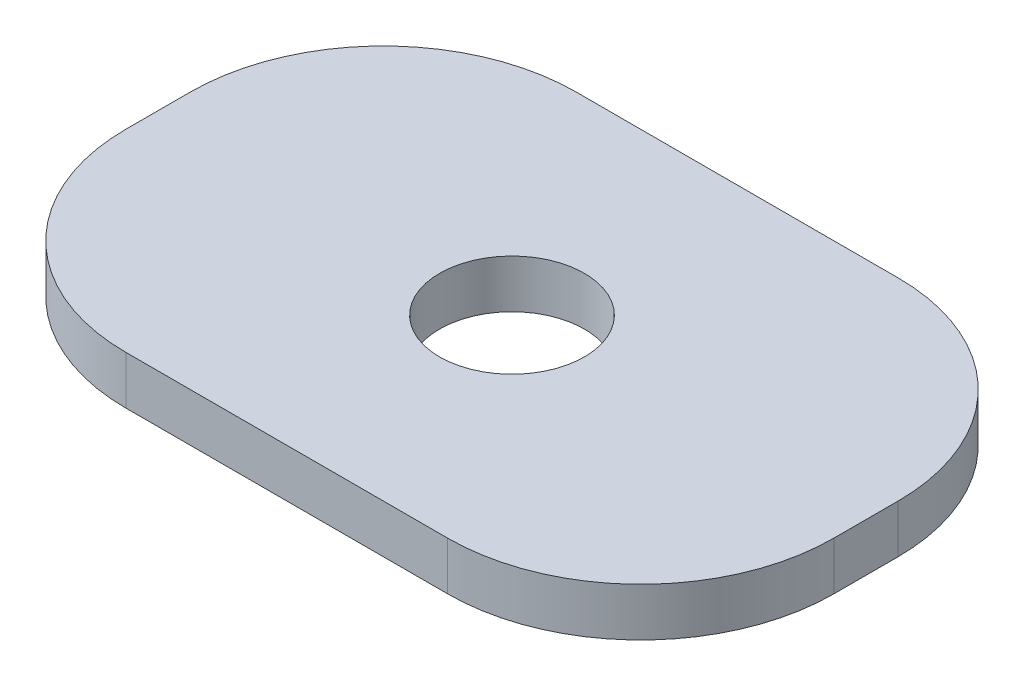
ISO-10303-21;
HEADER;
FILE_DESCRIPTION(('STEP AP214'),'2;1');
FILE_NAME('part.step','',(''),(''),'','','');
FILE_SCHEMA(('AUTOMOTIVE_DESIGN { 1 0 10303 214 1 1 1 1 }'));
ENDSEC;
DATA;
#1=APPLICATION_CONTEXT('core data for automotive mechanical design processes');
#2=APPLICATION_PROTOCOL_DEFINITION('international standard','automotive_design',2000,#1);
#3=PRODUCT_CONTEXT('',#1,'mechanical');
#4=PRODUCT('Part','Part','',(#3));
#5=PRODUCT_RELATED_PRODUCT_CATEGORY('part','',(#4));
#6=PRODUCT_DEFINITION_FORMATION('','',#4);
#7=PRODUCT_DEFINITION_CONTEXT('part definition',#1,'design');
#8=PRODUCT_DEFINITION('design','',#6,#7);
#9=PRODUCT_DEFINITION_SHAPE('','',#8);
#10=(LENGTH_UNIT() NAMED_UNIT(*) SI_UNIT(.MILLI.,.METRE.));
#11=(NAMED_UNIT(*) PLANE_ANGLE_UNIT() SI_UNIT($,.RADIAN.));
#12=(NAMED_UNIT(*) SI_UNIT($,.STERADIAN.) SOLID_ANGLE_UNIT());
#13=UNCERTAINTY_MEASURE_WITH_UNIT(LENGTH_MEASURE(1.E-05),#10,'distance_accuracy_value','');
#14=(GEOMETRIC_REPRESENTATION_CONTEXT(3) GLOBAL_UNCERTAINTY_ASSIGNED_CONTEXT((#13)) GLOBAL_UNIT_ASSIGNED_CONTEXT((#10,
#11,#12)) REPRESENTATION_CONTEXT('',''));
#15=CARTESIAN_POINT('',(0.,0.,0.));
#16=DIRECTION('',(0.,0.,1.));
#17=DIRECTION('',(1.,0.,0.));
#18=AXIS2_PLACEMENT_3D('',#15,#16,#17);
#19=CARTESIAN_POINT('',(34.925,4.7625,22.225));
#20=DIRECTION('',(-1.,0.,0.));
#21=DIRECTION('',(0.,0.,1.));
#22=AXIS2_PLACEMENT_3D('',#19,#20,#21);
#23=PLANE('',#22);
#24=DIRECTION('',(0.,0.,-1.));
#25=VECTOR('',#24,1.);
#26=CARTESIAN_POINT('',(34.925,4.7625,22.225));
#27=LINE('',#26,#25);
#28=CARTESIAN_POINT('',(34.925,4.7625,3.175));
#29=VERTEX_POINT('',#28);
#30=CARTESIAN_POINT('',(34.925,4.7625,-3.175));
#31=VERTEX_POINT('',#30);
#32=EDGE_CURVE('E130',#29,#31,#27,.T.);
#33=ORIENTED_EDGE('',*,*,#32,.F.);
#34=DIRECTION('',(0.,-1.,0.));
#35=VECTOR('',#34,1.);
#36=CARTESIAN_POINT('',(34.925,4.7625,3.175));
#37=LINE('',#36,#35);
#38=CARTESIAN_POINT('',(34.925,0.,3.175));
#39=VERTEX_POINT('',#38);
#40=EDGE_CURVE('E149',#29,#39,#37,.T.);
#41=ORIENTED_EDGE('',*,*,#40,.T.);
#42=DIRECTION('',(0.,0.,-1.));
#43=VECTOR('',#42,1.);
#44=CARTESIAN_POINT('',(34.925,0.,22.225));
#45=LINE('',#44,#43);
#46=CARTESIAN_POINT('',(34.925,0.,-3.175));
#47=VERTEX_POINT('',#46);
#48=EDGE_CURVE('E132',#39,#47,#45,.T.);
#49=ORIENTED_EDGE('',*,*,#48,.T.);
#50=DIRECTION('',(0.,-1.,0.));
#51=VECTOR('',#50,1.);
#52=CARTESIAN_POINT('',(34.925,4.7625,-3.175));
#53=LINE('',#52,#51);
#54=EDGE_CURVE('E147',#47,#31,#53,.F.);
#55=ORIENTED_EDGE('',*,*,#54,.T.);
#56=EDGE_LOOP('',(#33,#41,#49,#55));
#57=FACE_BOUND('',#56,.T.);
#58=ADVANCED_FACE('F33',(#57),#23,.F.);
#59=CARTESIAN_POINT('',(-34.925,4.7625,-22.225));
#60=DIRECTION('',(0.,0.,1.));
#61=DIRECTION('',(1.,0.,0.));
#62=AXIS2_PLACEMENT_3D('',#59,#60,#61);
#63=PLANE('',#62);
#64=DIRECTION('',(-1.,0.,0.));
#65=VECTOR('',#64,1.);
#66=CARTESIAN_POINT('',(-34.925,4.7625,-22.225));
#67=LINE('',#66,#65);
#68=CARTESIAN_POINT('',(15.875,4.7625,-22.225));
#69=VERTEX_POINT('',#68);
#70=CARTESIAN_POINT('',(-15.875,4.7625,-22.225));
#71=VERTEX_POINT('',#70);
#72=EDGE_CURVE('E165',#69,#71,#67,.T.);
#73=ORIENTED_EDGE('',*,*,#72,.F.);
#74=DIRECTION('',(0.,-1.,0.));
#75=VECTOR('',#74,1.);
#76=CARTESIAN_POINT('',(15.875,4.7625,-22.225));
#77=LINE('',#76,#75);
#78=CARTESIAN_POINT('',(15.875,0.,-22.225));
#79=VERTEX_POINT('',#78);
#80=EDGE_CURVE('E11',#69,#79,#77,.T.);
#81=ORIENTED_EDGE('',*,*,#80,.T.);
#82=DIRECTION('',(-1.,0.,0.));
#83=VECTOR('',#82,1.);
#84=CARTESIAN_POINT('',(-34.925,0.,-22.225));
#85=LINE('',#84,#83);
#86=CARTESIAN_POINT('',(-15.875,0.,-22.225));
#87=VERTEX_POINT('',#86);
#88=EDGE_CURVE('E128',#79,#87,#85,.T.);
#89=ORIENTED_EDGE('',*,*,#88,.T.);
#90=DIRECTION('',(0.,-1.,0.));
#91=VECTOR('',#90,1.);
#92=CARTESIAN_POINT('',(-15.875,4.7625,-22.225));
#93=LINE('',#92,#91);
#94=EDGE_CURVE('E108',#87,#71,#93,.F.);
#95=ORIENTED_EDGE('',*,*,#94,.T.);
#96=EDGE_LOOP('',(#73,#81,#89,#95));
#97=FACE_BOUND('',#96,.T.);
#98=ADVANCED_FACE('F198',(#97),#63,.F.);
#99=CARTESIAN_POINT('',(-34.925,4.7625,22.225));
#100=DIRECTION('',(1.,0.,0.));
#101=DIRECTION('',(0.,0.,-1.));
#102=AXIS2_PLACEMENT_3D('',#99,#100,#101);
#103=PLANE('',#102);
#104=DIRECTION('',(0.,0.,1.));
#105=VECTOR('',#104,1.);
#106=CARTESIAN_POINT('',(-34.925,4.7625,22.225));
#107=LINE('',#106,#105);
#108=CARTESIAN_POINT('',(-34.925,4.7625,-3.175));
#109=VERTEX_POINT('',#108);
#110=CARTESIAN_POINT('',(-34.925,4.7625,3.175));
#111=VERTEX_POINT('',#110);
#112=EDGE_CURVE('E121',#109,#111,#107,.T.);
#113=ORIENTED_EDGE('',*,*,#112,.F.);
#114=DIRECTION('',(0.,-1.,0.));
#115=VECTOR('',#114,1.);
#116=CARTESIAN_POINT('',(-34.925,4.7625,-3.175));
#117=LINE('',#116,#115);
#118=CARTESIAN_POINT('',(-34.925,0.,-3.175));
#119=VERTEX_POINT('',#118);
#120=EDGE_CURVE('E106',#109,#119,#117,.T.);
#121=ORIENTED_EDGE('',*,*,#120,.T.);
#122=DIRECTION('',(0.,0.,1.));
#123=VECTOR('',#122,1.);
#124=CARTESIAN_POINT('',(-34.925,0.,22.225));
#125=LINE('',#124,#123);
#126=CARTESIAN_POINT('',(-34.925,0.,3.175));
#127=VERTEX_POINT('',#126);
#128=EDGE_CURVE('E118',#119,#127,#125,.T.);
#129=ORIENTED_EDGE('',*,*,#128,.T.);
#130=DIRECTION('',(0.,-1.,0.));
#131=VECTOR('',#130,1.);
#132=CARTESIAN_POINT('',(-34.925,4.7625,3.175));
#133=LINE('',#132,#131);
#134=EDGE_CURVE('E122',#127,#111,#133,.F.);
#135=ORIENTED_EDGE('',*,*,#134,.T.);
#136=EDGE_LOOP('',(#113,#121,#129,#135));
#137=FACE_BOUND('',#136,.T.);
#138=ADVANCED_FACE('F117',(#137),#103,.F.);
#139=CARTESIAN_POINT('',(-34.925,4.7625,22.225));
#140=DIRECTION('',(0.,0.,-1.));
#141=DIRECTION('',(-1.,0.,0.));
#142=AXIS2_PLACEMENT_3D('',#139,#140,#141);
#143=PLANE('',#142);
#144=DIRECTION('',(1.,0.,0.));
#145=VECTOR('',#144,1.);
#146=CARTESIAN_POINT('',(-34.925,0.,22.225));
#147=LINE('',#146,#145);
#148=CARTESIAN_POINT('',(-15.875,0.,22.225));
#149=VERTEX_POINT('',#148);
#150=CARTESIAN_POINT('',(15.875,0.,22.225));
#151=VERTEX_POINT('',#150);
#152=EDGE_CURVE('E127',#149,#151,#147,.T.);
#153=ORIENTED_EDGE('',*,*,#152,.T.);
#154=DIRECTION('',(0.,-1.,0.));
#155=VECTOR('',#154,1.);
#156=CARTESIAN_POINT('',(15.875,4.7625,22.225));
#157=LINE('',#156,#155);
#158=CARTESIAN_POINT('',(15.875,4.7625,22.225));
#159=VERTEX_POINT('',#158);
#160=EDGE_CURVE('E56',#151,#159,#157,.F.);
#161=ORIENTED_EDGE('',*,*,#160,.T.);
#162=DIRECTION('',(1.,0.,0.));
#163=VECTOR('',#162,1.);
#164=CARTESIAN_POINT('',(-34.925,4.7625,22.225));
#165=LINE('',#164,#163);
#166=CARTESIAN_POINT('',(-15.875,4.7625,22.225));
#167=VERTEX_POINT('',#166);
#168=EDGE_CURVE('E136',#167,#159,#165,.T.);
#169=ORIENTED_EDGE('',*,*,#168,.F.);
#170=DIRECTION('',(0.,-1.,0.));
#171=VECTOR('',#170,1.);
#172=CARTESIAN_POINT('',(-15.875,4.7625,22.225));
#173=LINE('',#172,#171);
#174=EDGE_CURVE('E144',#167,#149,#173,.T.);
#175=ORIENTED_EDGE('',*,*,#174,.T.);
#176=EDGE_LOOP('',(#153,#161,#169,#175));
#177=FACE_BOUND('',#176,.T.);
#178=ADVANCED_FACE('F168',(#177),#143,.F.);
#179=CARTESIAN_POINT('',(0.,4.7625,0.));
#180=DIRECTION('',(0.,-1.,0.));
#181=DIRECTION('',(0.,0.,-1.));
#182=AXIS2_PLACEMENT_3D('',#179,#180,#181);
#183=PLANE('',#182);
#184=CARTESIAN_POINT('',(0.,4.7625,0.));
#185=DIRECTION('',(0.,1.,0.));
#186=DIRECTION('',(0.,0.,1.));
#187=AXIS2_PLACEMENT_3D('',#184,#185,#186);
#188=CIRCLE('',#187,7.14375);
#189=CARTESIAN_POINT('',(0.,4.7625,7.14375));
#190=VERTEX_POINT('',#189);
#191=EDGE_CURVE('E178',#190,#190,#188,.T.);
#192=ORIENTED_EDGE('',*,*,#191,.F.);
#193=EDGE_LOOP('',(#192));
#194=FACE_BOUND('',#193,.T.);
#195=ORIENTED_EDGE('',*,*,#168,.T.);
#196=CARTESIAN_POINT('',(15.875,4.7625,3.175));
#197=DIRECTION('',(0.,-1.,0.));
#198=DIRECTION('',(0.,0.,-1.));
#199=AXIS2_PLACEMENT_3D('',#196,#197,#198);
#200=CIRCLE('',#199,19.05);
#201=EDGE_CURVE('E41',#159,#29,#200,.F.);
#202=ORIENTED_EDGE('',*,*,#201,.T.);
#203=ORIENTED_EDGE('',*,*,#32,.T.);
#204=CARTESIAN_POINT('',(15.875,4.7625,-3.175));
#205=DIRECTION('',(0.,-1.,0.));
#206=DIRECTION('',(0.,0.,-1.));
#207=AXIS2_PLACEMENT_3D('',#204,#205,#206);
#208=CIRCLE('',#207,19.05);
#209=EDGE_CURVE('E48',#31,#69,#208,.F.);
#210=ORIENTED_EDGE('',*,*,#209,.T.);
#211=ORIENTED_EDGE('',*,*,#72,.T.);
#212=CARTESIAN_POINT('',(-15.875,4.7625,-3.175));
#213=DIRECTION('',(0.,-1.,0.));
#214=DIRECTION('',(0.,0.,-1.));
#215=AXIS2_PLACEMENT_3D('',#212,#213,#214);
#216=CIRCLE('',#215,19.05);
#217=EDGE_CURVE('E142',#71,#109,#216,.F.);
#218=ORIENTED_EDGE('',*,*,#217,.T.);
#219=ORIENTED_EDGE('',*,*,#112,.T.);
#220=CARTESIAN_POINT('',(-15.875,4.7625,3.175));
#221=DIRECTION('',(0.,-1.,0.));
#222=DIRECTION('',(0.,0.,-1.));
#223=AXIS2_PLACEMENT_3D('',#220,#221,#222);
#224=CIRCLE('',#223,19.05);
#225=EDGE_CURVE('E140',#111,#167,#224,.F.);
#226=ORIENTED_EDGE('',*,*,#225,.T.);
#227=EDGE_LOOP('',(#195,#202,#203,#210,#211,#218,#219,#226));
#228=FACE_BOUND('',#227,.T.);
#229=ADVANCED_FACE('F159',(#194,#228),#183,.F.);
#230=CARTESIAN_POINT('',(0.,0.,0.));
#231=DIRECTION('',(0.,-1.,0.));
#232=DIRECTION('',(0.,0.,-1.));
#233=AXIS2_PLACEMENT_3D('',#230,#231,#232);
#234=PLANE('',#233);
#235=CARTESIAN_POINT('',(0.,0.,0.));
#236=DIRECTION('',(0.,1.,0.));
#237=DIRECTION('',(0.,0.,1.));
#238=AXIS2_PLACEMENT_3D('',#235,#236,#237);
#239=CIRCLE('',#238,7.14375);
#240=CARTESIAN_POINT('',(0.,0.,7.14375));
#241=VERTEX_POINT('',#240);
#242=EDGE_CURVE('E176',#241,#241,#239,.T.);
#243=ORIENTED_EDGE('',*,*,#242,.T.);
#244=EDGE_LOOP('',(#243));
#245=FACE_BOUND('',#244,.T.);
#246=ORIENTED_EDGE('',*,*,#48,.F.);
#247=CARTESIAN_POINT('',(15.875,0.,3.175));
#248=DIRECTION('',(0.,-1.,0.));
#249=DIRECTION('',(0.,0.,-1.));
#250=AXIS2_PLACEMENT_3D('',#247,#248,#249);
#251=CIRCLE('',#250,19.05);
#252=EDGE_CURVE('E154',#39,#151,#251,.T.);
#253=ORIENTED_EDGE('',*,*,#252,.T.);
#254=ORIENTED_EDGE('',*,*,#152,.F.);
#255=CARTESIAN_POINT('',(-15.875,0.,3.175));
#256=DIRECTION('',(0.,-1.,0.));
#257=DIRECTION('',(0.,0.,-1.));
#258=AXIS2_PLACEMENT_3D('',#255,#256,#257);
#259=CIRCLE('',#258,19.05);
#260=EDGE_CURVE('E112',#149,#127,#259,.T.);
#261=ORIENTED_EDGE('',*,*,#260,.T.);
#262=ORIENTED_EDGE('',*,*,#128,.F.);
#263=CARTESIAN_POINT('',(-15.875,0.,-3.175));
#264=DIRECTION('',(0.,-1.,0.));
#265=DIRECTION('',(0.,0.,-1.));
#266=AXIS2_PLACEMENT_3D('',#263,#264,#265);
#267=CIRCLE('',#266,19.05);
#268=EDGE_CURVE('E102',#119,#87,#267,.T.);
#269=ORIENTED_EDGE('',*,*,#268,.T.);
#270=ORIENTED_EDGE('',*,*,#88,.F.);
#271=CARTESIAN_POINT('',(15.875,0.,-3.175));
#272=DIRECTION('',(0.,-1.,0.));
#273=DIRECTION('',(0.,0.,-1.));
#274=AXIS2_PLACEMENT_3D('',#271,#272,#273);
#275=CIRCLE('',#274,19.05);
#276=EDGE_CURVE('E152',#79,#47,#275,.T.);
#277=ORIENTED_EDGE('',*,*,#276,.T.);
#278=EDGE_LOOP('',(#246,#253,#254,#261,#262,#269,#270,#277));
#279=FACE_BOUND('',#278,.T.);
#280=ADVANCED_FACE('F125',(#245,#279),#234,.T.);
#281=CARTESIAN_POINT('',(0.,0.,0.));
#282=DIRECTION('',(0.,1.,0.));
#283=DIRECTION('',(0.,0.,1.));
#284=AXIS2_PLACEMENT_3D('',#281,#282,#283);
#285=CYLINDRICAL_SURFACE('',#284,7.14375);
#286=ORIENTED_EDGE('',*,*,#242,.F.);
#287=EDGE_LOOP('',(#286));
#288=FACE_BOUND('',#287,.T.);
#289=ORIENTED_EDGE('',*,*,#191,.T.);
#290=EDGE_LOOP('',(#289));
#291=FACE_BOUND('',#290,.T.);
#292=ADVANCED_FACE('F186',(#288,#291),#285,.F.);
#293=CARTESIAN_POINT('',(-15.875,4.7625,-3.175));
#294=DIRECTION('',(0.,-1.,0.));
#295=DIRECTION('',(0.,0.,-1.));
#296=AXIS2_PLACEMENT_3D('',#293,#294,#295);
#297=CYLINDRICAL_SURFACE('',#296,19.05);
#298=ORIENTED_EDGE('',*,*,#217,.F.);
#299=ORIENTED_EDGE('',*,*,#94,.F.);
#300=ORIENTED_EDGE('',*,*,#268,.F.);
#301=ORIENTED_EDGE('',*,*,#120,.F.);
#302=EDGE_LOOP('',(#298,#299,#300,#301));
#303=FACE_BOUND('',#302,.T.);
#304=ADVANCED_FACE('F105',(#303),#297,.T.);
#305=CARTESIAN_POINT('',(-15.875,4.7625,3.175));
#306=DIRECTION('',(0.,-1.,0.));
#307=DIRECTION('',(0.,0.,-1.));
#308=AXIS2_PLACEMENT_3D('',#305,#306,#307);
#309=CYLINDRICAL_SURFACE('',#308,19.05);
#310=ORIENTED_EDGE('',*,*,#225,.F.);
#311=ORIENTED_EDGE('',*,*,#134,.F.);
#312=ORIENTED_EDGE('',*,*,#260,.F.);
#313=ORIENTED_EDGE('',*,*,#174,.F.);
#314=EDGE_LOOP('',(#310,#311,#312,#313));
#315=FACE_BOUND('',#314,.T.);
#316=ADVANCED_FACE('F172',(#315),#309,.T.);
#317=CARTESIAN_POINT('',(15.875,4.7625,3.175));
#318=DIRECTION('',(0.,-1.,0.));
#319=DIRECTION('',(0.,0.,-1.));
#320=AXIS2_PLACEMENT_3D('',#317,#318,#319);
#321=CYLINDRICAL_SURFACE('',#320,19.05);
#322=ORIENTED_EDGE('',*,*,#201,.F.);
#323=ORIENTED_EDGE('',*,*,#160,.F.);
#324=ORIENTED_EDGE('',*,*,#252,.F.);
#325=ORIENTED_EDGE('',*,*,#40,.F.);
#326=EDGE_LOOP('',(#322,#323,#324,#325));
#327=FACE_BOUND('',#326,.T.);
#328=ADVANCED_FACE('F167',(#327),#321,.T.);
#329=CARTESIAN_POINT('',(15.875,4.7625,-3.175));
#330=DIRECTION('',(0.,-1.,0.));
#331=DIRECTION('',(0.,0.,-1.));
#332=AXIS2_PLACEMENT_3D('',#329,#330,#331);
#333=CYLINDRICAL_SURFACE('',#332,19.05);
#334=ORIENTED_EDGE('',*,*,#209,.F.);
#335=ORIENTED_EDGE('',*,*,#54,.F.);
#336=ORIENTED_EDGE('',*,*,#276,.F.);
#337=ORIENTED_EDGE('',*,*,#80,.F.);
#338=EDGE_LOOP('',(#334,#335,#336,#337));
#339=FACE_BOUND('',#338,.T.);
#340=ADVANCED_FACE('F35',(#339),#333,.T.);
#341=CLOSED_SHELL('',(#58,#98,#138,#178,#229,#280,#292,#304,#316,#328,#340));
#342=MANIFOLD_SOLID_BREP('B2',#341);
#343=ADVANCED_BREP_SHAPE_REPRESENTATION('',(#18,#342),#14);
#344=SHAPE_DEFINITION_REPRESENTATION(#9,#343);
ENDSEC;
END-ISO-10303-21;
